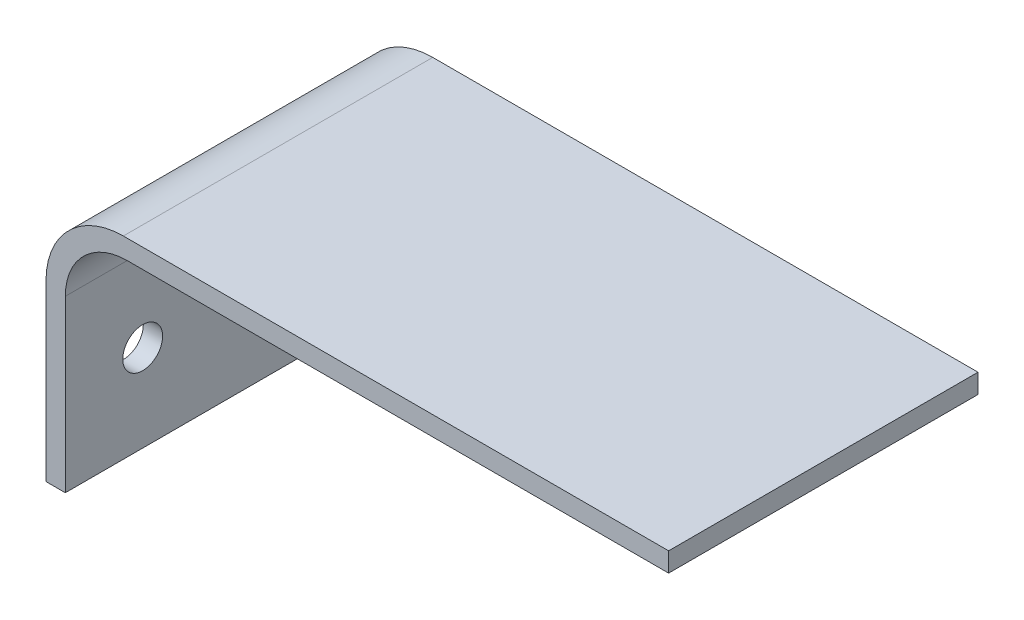
ISO-10303-21;
HEADER;
FILE_DESCRIPTION(('STEP AP214'),'2;1');
FILE_NAME('part.step','',(''),(''),'','','');
FILE_SCHEMA(('AUTOMOTIVE_DESIGN { 1 0 10303 214 1 1 1 1 }'));
ENDSEC;
DATA;
#1=APPLICATION_CONTEXT('core data for automotive mechanical design processes');
#2=APPLICATION_PROTOCOL_DEFINITION('international standard','automotive_design',2000,#1);
#3=PRODUCT_CONTEXT('',#1,'mechanical');
#4=PRODUCT('Part','Part','',(#3));
#5=PRODUCT_RELATED_PRODUCT_CATEGORY('part','',(#4));
#6=PRODUCT_DEFINITION_FORMATION('','',#4);
#7=PRODUCT_DEFINITION_CONTEXT('part definition',#1,'design');
#8=PRODUCT_DEFINITION('design','',#6,#7);
#9=PRODUCT_DEFINITION_SHAPE('','',#8);
#10=(LENGTH_UNIT() NAMED_UNIT(*) SI_UNIT(.MILLI.,.METRE.));
#11=(NAMED_UNIT(*) PLANE_ANGLE_UNIT() SI_UNIT($,.RADIAN.));
#12=(NAMED_UNIT(*) SI_UNIT($,.STERADIAN.) SOLID_ANGLE_UNIT());
#13=UNCERTAINTY_MEASURE_WITH_UNIT(LENGTH_MEASURE(1.E-05),#10,'distance_accuracy_value','');
#14=(GEOMETRIC_REPRESENTATION_CONTEXT(3) GLOBAL_UNCERTAINTY_ASSIGNED_CONTEXT((#13)) GLOBAL_UNIT_ASSIGNED_CONTEXT((#10,
#11,#12)) REPRESENTATION_CONTEXT('',''));
#15=CARTESIAN_POINT('',(0.,0.,0.));
#16=DIRECTION('',(0.,0.,1.));
#17=DIRECTION('',(1.,0.,0.));
#18=AXIS2_PLACEMENT_3D('',#15,#16,#17);
#19=CARTESIAN_POINT('',(-76.7779870962112,16.0274236258985,101.6));
#20=DIRECTION('',(0.,0.,-1.));
#21=DIRECTION('',(-1.,0.,0.));
#22=AXIS2_PLACEMENT_3D('',#19,#20,#21);
#23=CYLINDRICAL_SURFACE('',#22,25.4);
#24=CARTESIAN_POINT('',(-76.7779870962112,16.0274236258985,0.));
#25=DIRECTION('',(0.,0.,1.));
#26=DIRECTION('',(-1.,0.,0.));
#27=AXIS2_PLACEMENT_3D('',#24,#25,#26);
#28=CIRCLE('',#27,25.4);
#29=CARTESIAN_POINT('',(-76.7779870962112,41.4274236258985,0.));
#30=VERTEX_POINT('',#29);
#31=CARTESIAN_POINT('',(-102.177987096211,16.0274236258985,0.));
#32=VERTEX_POINT('',#31);
#33=EDGE_CURVE('E141',#30,#32,#28,.T.);
#34=ORIENTED_EDGE('',*,*,#33,.T.);
#35=DIRECTION('',(0.,0.,-1.));
#36=VECTOR('',#35,1.);
#37=CARTESIAN_POINT('',(-102.177987096211,16.0274236258985,101.6));
#38=LINE('',#37,#36);
#39=CARTESIAN_POINT('',(-102.177987096211,16.0274236258985,101.6));
#40=VERTEX_POINT('',#39);
#41=EDGE_CURVE('E11',#40,#32,#38,.T.);
#42=ORIENTED_EDGE('',*,*,#41,.F.);
#43=CARTESIAN_POINT('',(-76.7779870962112,16.0274236258985,101.6));
#44=DIRECTION('',(0.,0.,1.));
#45=DIRECTION('',(-1.,0.,0.));
#46=AXIS2_PLACEMENT_3D('',#43,#44,#45);
#47=CIRCLE('',#46,25.4);
#48=CARTESIAN_POINT('',(-76.7779870962112,41.4274236258985,101.6));
#49=VERTEX_POINT('',#48);
#50=EDGE_CURVE('E155',#49,#40,#47,.T.);
#51=ORIENTED_EDGE('',*,*,#50,.F.);
#52=DIRECTION('',(0.,0.,-1.));
#53=VECTOR('',#52,1.);
#54=CARTESIAN_POINT('',(-76.7779870962112,41.4274236258985,101.6));
#55=LINE('',#54,#53);
#56=EDGE_CURVE('E137',#49,#30,#55,.T.);
#57=ORIENTED_EDGE('',*,*,#56,.T.);
#58=EDGE_LOOP('',(#34,#42,#51,#57));
#59=FACE_BOUND('',#58,.T.);
#60=ADVANCED_FACE('F43',(#59),#23,.T.);
#61=CARTESIAN_POINT('',(-102.177987096211,-41.1225763741016,101.6));
#62=DIRECTION('',(1.,0.,0.));
#63=DIRECTION('',(0.,0.,-1.));
#64=AXIS2_PLACEMENT_3D('',#61,#62,#63);
#65=PLANE('',#64);
#66=CARTESIAN_POINT('',(-102.177987096211,-12.5475763741016,25.4));
#67=DIRECTION('',(-1.,0.,0.));
#68=DIRECTION('',(0.,0.,1.));
#69=AXIS2_PLACEMENT_3D('',#66,#67,#68);
#70=CIRCLE('',#69,6.54812);
#71=CARTESIAN_POINT('',(-102.177987096211,-12.5475763741016,31.94812));
#72=VERTEX_POINT('',#71);
#73=EDGE_CURVE('E168',#72,#72,#70,.T.);
#74=ORIENTED_EDGE('',*,*,#73,.F.);
#75=EDGE_LOOP('',(#74));
#76=FACE_BOUND('',#75,.T.);
#77=CARTESIAN_POINT('',(-102.177987096211,-12.5475763741016,76.2));
#78=DIRECTION('',(-1.,0.,0.));
#79=DIRECTION('',(0.,0.,-1.));
#80=AXIS2_PLACEMENT_3D('',#77,#78,#79);
#81=CIRCLE('',#80,6.54811999999999);
#82=CARTESIAN_POINT('',(-102.177987096211,-12.5475763741016,69.65188));
#83=VERTEX_POINT('',#82);
#84=EDGE_CURVE('E173',#83,#83,#81,.T.);
#85=ORIENTED_EDGE('',*,*,#84,.F.);
#86=EDGE_LOOP('',(#85));
#87=FACE_BOUND('',#86,.T.);
#88=DIRECTION('',(0.,-1.,0.));
#89=VECTOR('',#88,1.);
#90=CARTESIAN_POINT('',(-102.177987096211,-41.1225763741016,0.));
#91=LINE('',#90,#89);
#92=CARTESIAN_POINT('',(-102.177987096211,-41.1225763741016,0.));
#93=VERTEX_POINT('',#92);
#94=EDGE_CURVE('E144',#32,#93,#91,.T.);
#95=ORIENTED_EDGE('',*,*,#94,.T.);
#96=DIRECTION('',(0.,0.,-1.));
#97=VECTOR('',#96,1.);
#98=CARTESIAN_POINT('',(-102.177987096211,-41.1225763741016,101.6));
#99=LINE('',#98,#97);
#100=CARTESIAN_POINT('',(-102.177987096211,-41.1225763741016,101.6));
#101=VERTEX_POINT('',#100);
#102=EDGE_CURVE('E52',#101,#93,#99,.T.);
#103=ORIENTED_EDGE('',*,*,#102,.F.);
#104=DIRECTION('',(0.,-1.,0.));
#105=VECTOR('',#104,1.);
#106=CARTESIAN_POINT('',(-102.177987096211,-41.1225763741016,101.6));
#107=LINE('',#106,#105);
#108=EDGE_CURVE('E104',#40,#101,#107,.T.);
#109=ORIENTED_EDGE('',*,*,#108,.F.);
#110=ORIENTED_EDGE('',*,*,#41,.T.);
#111=EDGE_LOOP('',(#95,#103,#109,#110));
#112=FACE_BOUND('',#111,.T.);
#113=ADVANCED_FACE('F213',(#76,#87,#112),#65,.F.);
#114=CARTESIAN_POINT('',(-95.8279870962112,-41.1225763741016,101.6));
#115=DIRECTION('',(0.,1.,0.));
#116=DIRECTION('',(-1.,0.,0.));
#117=AXIS2_PLACEMENT_3D('',#114,#115,#116);
#118=PLANE('',#117);
#119=DIRECTION('',(1.,0.,0.));
#120=VECTOR('',#119,1.);
#121=CARTESIAN_POINT('',(-95.8279870962112,-41.1225763741016,0.));
#122=LINE('',#121,#120);
#123=CARTESIAN_POINT('',(-95.8279870962112,-41.1225763741016,0.));
#124=VERTEX_POINT('',#123);
#125=EDGE_CURVE('E146',#93,#124,#122,.T.);
#126=ORIENTED_EDGE('',*,*,#125,.T.);
#127=DIRECTION('',(0.,0.,-1.));
#128=VECTOR('',#127,1.);
#129=CARTESIAN_POINT('',(-95.8279870962112,-41.1225763741016,101.6));
#130=LINE('',#129,#128);
#131=CARTESIAN_POINT('',(-95.8279870962112,-41.1225763741016,101.6));
#132=VERTEX_POINT('',#131);
#133=EDGE_CURVE('E162',#132,#124,#130,.T.);
#134=ORIENTED_EDGE('',*,*,#133,.F.);
#135=DIRECTION('',(1.,0.,0.));
#136=VECTOR('',#135,1.);
#137=CARTESIAN_POINT('',(-95.8279870962112,-41.1225763741016,101.6));
#138=LINE('',#137,#136);
#139=EDGE_CURVE('E182',#101,#132,#138,.T.);
#140=ORIENTED_EDGE('',*,*,#139,.F.);
#141=ORIENTED_EDGE('',*,*,#102,.T.);
#142=EDGE_LOOP('',(#126,#134,#140,#141));
#143=FACE_BOUND('',#142,.T.);
#144=ADVANCED_FACE('F218',(#143),#118,.F.);
#145=CARTESIAN_POINT('',(-95.8279870962112,14.7574236258984,101.6));
#146=DIRECTION('',(-1.,0.,0.));
#147=DIRECTION('',(0.,-1.,0.));
#148=AXIS2_PLACEMENT_3D('',#145,#146,#147);
#149=PLANE('',#148);
#150=CARTESIAN_POINT('',(-95.8279870962112,-12.5475763741016,25.4));
#151=DIRECTION('',(-1.,0.,0.));
#152=DIRECTION('',(0.,-1.,0.));
#153=AXIS2_PLACEMENT_3D('',#150,#151,#152);
#154=CIRCLE('',#153,6.54812);
#155=CARTESIAN_POINT('',(-95.8279870962112,-19.0956963741016,25.4));
#156=VERTEX_POINT('',#155);
#157=EDGE_CURVE('E46',#156,#156,#154,.T.);
#158=ORIENTED_EDGE('',*,*,#157,.T.);
#159=EDGE_LOOP('',(#158));
#160=FACE_BOUND('',#159,.T.);
#161=CARTESIAN_POINT('',(-95.8279870962112,-12.5475763741016,76.2));
#162=DIRECTION('',(-1.,0.,0.));
#163=DIRECTION('',(0.,-1.,0.));
#164=AXIS2_PLACEMENT_3D('',#161,#162,#163);
#165=CIRCLE('',#164,6.54811999999999);
#166=CARTESIAN_POINT('',(-95.8279870962112,-19.0956963741016,76.2));
#167=VERTEX_POINT('',#166);
#168=EDGE_CURVE('E166',#167,#167,#165,.T.);
#169=ORIENTED_EDGE('',*,*,#168,.T.);
#170=EDGE_LOOP('',(#169));
#171=FACE_BOUND('',#170,.T.);
#172=DIRECTION('',(0.,1.,0.));
#173=VECTOR('',#172,1.);
#174=CARTESIAN_POINT('',(-95.8279870962112,14.7574236258984,0.));
#175=LINE('',#174,#173);
#176=CARTESIAN_POINT('',(-95.8279870962112,14.7574236258984,0.));
#177=VERTEX_POINT('',#176);
#178=EDGE_CURVE('E148',#124,#177,#175,.T.);
#179=ORIENTED_EDGE('',*,*,#178,.T.);
#180=DIRECTION('',(0.,0.,-1.));
#181=VECTOR('',#180,1.);
#182=CARTESIAN_POINT('',(-95.8279870962112,14.7574236258984,101.6));
#183=LINE('',#182,#181);
#184=CARTESIAN_POINT('',(-95.8279870962112,14.7574236258984,101.6));
#185=VERTEX_POINT('',#184);
#186=EDGE_CURVE('E159',#185,#177,#183,.T.);
#187=ORIENTED_EDGE('',*,*,#186,.F.);
#188=DIRECTION('',(0.,1.,0.));
#189=VECTOR('',#188,1.);
#190=CARTESIAN_POINT('',(-95.8279870962112,14.7574236258984,101.6));
#191=LINE('',#190,#189);
#192=EDGE_CURVE('E184',#132,#185,#191,.T.);
#193=ORIENTED_EDGE('',*,*,#192,.F.);
#194=ORIENTED_EDGE('',*,*,#133,.T.);
#195=EDGE_LOOP('',(#179,#187,#193,#194));
#196=FACE_BOUND('',#195,.T.);
#197=ADVANCED_FACE('F190',(#160,#171,#196),#149,.F.);
#198=CARTESIAN_POINT('',(-75.5079870962112,14.7574236258984,101.6));
#199=DIRECTION('',(0.,0.,-1.));
#200=DIRECTION('',(-1.,0.,0.));
#201=AXIS2_PLACEMENT_3D('',#198,#199,#200);
#202=CYLINDRICAL_SURFACE('',#201,20.32);
#203=CARTESIAN_POINT('',(-75.5079870962112,14.7574236258984,0.));
#204=DIRECTION('',(0.,0.,-1.));
#205=DIRECTION('',(-1.,0.,0.));
#206=AXIS2_PLACEMENT_3D('',#203,#204,#205);
#207=CIRCLE('',#206,20.32);
#208=CARTESIAN_POINT('',(-75.5079870962112,35.0774236258984,0.));
#209=VERTEX_POINT('',#208);
#210=EDGE_CURVE('E150',#177,#209,#207,.T.);
#211=ORIENTED_EDGE('',*,*,#210,.T.);
#212=DIRECTION('',(0.,0.,-1.));
#213=VECTOR('',#212,1.);
#214=CARTESIAN_POINT('',(-75.5079870962112,35.0774236258984,101.6));
#215=LINE('',#214,#213);
#216=CARTESIAN_POINT('',(-75.5079870962112,35.0774236258984,101.6));
#217=VERTEX_POINT('',#216);
#218=EDGE_CURVE('E132',#217,#209,#215,.T.);
#219=ORIENTED_EDGE('',*,*,#218,.F.);
#220=CARTESIAN_POINT('',(-75.5079870962112,14.7574236258984,101.6));
#221=DIRECTION('',(0.,0.,-1.));
#222=DIRECTION('',(-1.,0.,0.));
#223=AXIS2_PLACEMENT_3D('',#220,#221,#222);
#224=CIRCLE('',#223,20.32);
#225=EDGE_CURVE('E123',#185,#217,#224,.T.);
#226=ORIENTED_EDGE('',*,*,#225,.F.);
#227=ORIENTED_EDGE('',*,*,#186,.T.);
#228=EDGE_LOOP('',(#211,#219,#226,#227));
#229=FACE_BOUND('',#228,.T.);
#230=ADVANCED_FACE('F194',(#229),#202,.F.);
#231=CARTESIAN_POINT('',(102.292012903789,35.0774236258984,101.6));
#232=DIRECTION('',(0.,1.,0.));
#233=DIRECTION('',(0.,0.,1.));
#234=AXIS2_PLACEMENT_3D('',#231,#232,#233);
#235=PLANE('',#234);
#236=DIRECTION('',(1.,0.,0.));
#237=VECTOR('',#236,1.);
#238=CARTESIAN_POINT('',(102.292012903789,35.0774236258984,0.));
#239=LINE('',#238,#237);
#240=CARTESIAN_POINT('',(102.292012903789,35.0774236258984,0.));
#241=VERTEX_POINT('',#240);
#242=EDGE_CURVE('E131',#209,#241,#239,.T.);
#243=ORIENTED_EDGE('',*,*,#242,.T.);
#244=DIRECTION('',(0.,0.,-1.));
#245=VECTOR('',#244,1.);
#246=CARTESIAN_POINT('',(102.292012903789,35.0774236258984,101.6));
#247=LINE('',#246,#245);
#248=CARTESIAN_POINT('',(102.292012903789,35.0774236258984,101.6));
#249=VERTEX_POINT('',#248);
#250=EDGE_CURVE('E128',#249,#241,#247,.T.);
#251=ORIENTED_EDGE('',*,*,#250,.F.);
#252=DIRECTION('',(1.,0.,0.));
#253=VECTOR('',#252,1.);
#254=CARTESIAN_POINT('',(102.292012903789,35.0774236258984,101.6));
#255=LINE('',#254,#253);
#256=EDGE_CURVE('E117',#217,#249,#255,.T.);
#257=ORIENTED_EDGE('',*,*,#256,.F.);
#258=ORIENTED_EDGE('',*,*,#218,.T.);
#259=EDGE_LOOP('',(#243,#251,#257,#258));
#260=FACE_BOUND('',#259,.T.);
#261=ADVANCED_FACE('F129',(#260),#235,.F.);
#262=CARTESIAN_POINT('',(102.292012903789,35.0774236258984,101.6));
#263=DIRECTION('',(-1.,0.,0.));
#264=DIRECTION('',(0.,0.,1.));
#265=AXIS2_PLACEMENT_3D('',#262,#263,#264);
#266=PLANE('',#265);
#267=DIRECTION('',(0.,1.,0.));
#268=VECTOR('',#267,1.);
#269=CARTESIAN_POINT('',(102.292012903789,35.0774236258984,0.));
#270=LINE('',#269,#268);
#271=CARTESIAN_POINT('',(102.292012903789,41.4274236258985,0.));
#272=VERTEX_POINT('',#271);
#273=EDGE_CURVE('E90',#241,#272,#270,.T.);
#274=ORIENTED_EDGE('',*,*,#273,.T.);
#275=DIRECTION('',(0.,0.,-1.));
#276=VECTOR('',#275,1.);
#277=CARTESIAN_POINT('',(102.292012903789,41.4274236258985,101.6));
#278=LINE('',#277,#276);
#279=CARTESIAN_POINT('',(102.292012903789,41.4274236258985,101.6));
#280=VERTEX_POINT('',#279);
#281=EDGE_CURVE('E133',#280,#272,#278,.T.);
#282=ORIENTED_EDGE('',*,*,#281,.F.);
#283=DIRECTION('',(0.,1.,0.));
#284=VECTOR('',#283,1.);
#285=CARTESIAN_POINT('',(102.292012903789,35.0774236258984,101.6));
#286=LINE('',#285,#284);
#287=EDGE_CURVE('E121',#249,#280,#286,.T.);
#288=ORIENTED_EDGE('',*,*,#287,.F.);
#289=ORIENTED_EDGE('',*,*,#250,.T.);
#290=EDGE_LOOP('',(#274,#282,#288,#289));
#291=FACE_BOUND('',#290,.T.);
#292=ADVANCED_FACE('F135',(#291),#266,.F.);
#293=CARTESIAN_POINT('',(-76.7779870962112,41.4274236258985,101.6));
#294=DIRECTION('',(0.,-1.,0.));
#295=DIRECTION('',(0.,0.,-1.));
#296=AXIS2_PLACEMENT_3D('',#293,#294,#295);
#297=PLANE('',#296);
#298=DIRECTION('',(-1.,0.,0.));
#299=VECTOR('',#298,1.);
#300=CARTESIAN_POINT('',(-76.7779870962112,41.4274236258985,0.));
#301=LINE('',#300,#299);
#302=EDGE_CURVE('E96',#272,#30,#301,.T.);
#303=ORIENTED_EDGE('',*,*,#302,.T.);
#304=ORIENTED_EDGE('',*,*,#56,.F.);
#305=DIRECTION('',(-1.,0.,0.));
#306=VECTOR('',#305,1.);
#307=CARTESIAN_POINT('',(-76.7779870962112,41.4274236258985,101.6));
#308=LINE('',#307,#306);
#309=EDGE_CURVE('E61',#280,#49,#308,.T.);
#310=ORIENTED_EDGE('',*,*,#309,.F.);
#311=ORIENTED_EDGE('',*,*,#281,.T.);
#312=EDGE_LOOP('',(#303,#304,#310,#311));
#313=FACE_BOUND('',#312,.T.);
#314=ADVANCED_FACE('F202',(#313),#297,.F.);
#315=CARTESIAN_POINT('',(-76.7779870962112,16.0274236258985,101.6));
#316=DIRECTION('',(0.,0.,-1.));
#317=DIRECTION('',(-1.,0.,0.));
#318=AXIS2_PLACEMENT_3D('',#315,#316,#317);
#319=PLANE('',#318);
#320=ORIENTED_EDGE('',*,*,#50,.T.);
#321=ORIENTED_EDGE('',*,*,#108,.T.);
#322=ORIENTED_EDGE('',*,*,#139,.T.);
#323=ORIENTED_EDGE('',*,*,#192,.T.);
#324=ORIENTED_EDGE('',*,*,#225,.T.);
#325=ORIENTED_EDGE('',*,*,#256,.T.);
#326=ORIENTED_EDGE('',*,*,#287,.T.);
#327=ORIENTED_EDGE('',*,*,#309,.T.);
#328=EDGE_LOOP('',(#320,#321,#322,#323,#324,#325,#326,#327));
#329=FACE_BOUND('',#328,.T.);
#330=ADVANCED_FACE('F119',(#329),#319,.F.);
#331=CARTESIAN_POINT('',(-76.7779870962112,16.0274236258985,0.));
#332=DIRECTION('',(0.,0.,-1.));
#333=DIRECTION('',(-1.,0.,0.));
#334=AXIS2_PLACEMENT_3D('',#331,#332,#333);
#335=PLANE('',#334);
#336=ORIENTED_EDGE('',*,*,#33,.F.);
#337=ORIENTED_EDGE('',*,*,#302,.F.);
#338=ORIENTED_EDGE('',*,*,#273,.F.);
#339=ORIENTED_EDGE('',*,*,#242,.F.);
#340=ORIENTED_EDGE('',*,*,#210,.F.);
#341=ORIENTED_EDGE('',*,*,#178,.F.);
#342=ORIENTED_EDGE('',*,*,#125,.F.);
#343=ORIENTED_EDGE('',*,*,#94,.F.);
#344=EDGE_LOOP('',(#336,#337,#338,#339,#340,#341,#342,#343));
#345=FACE_BOUND('',#344,.T.);
#346=ADVANCED_FACE('F197',(#345),#335,.T.);
#347=CARTESIAN_POINT('',(202.622012903789,-12.5475763741016,76.2));
#348=DIRECTION('',(-1.,0.,0.));
#349=DIRECTION('',(0.,0.,1.));
#350=AXIS2_PLACEMENT_3D('',#347,#348,#349);
#351=CYLINDRICAL_SURFACE('',#350,6.54811999999999);
#352=ORIENTED_EDGE('',*,*,#84,.T.);
#353=EDGE_LOOP('',(#352));
#354=FACE_BOUND('',#353,.T.);
#355=ORIENTED_EDGE('',*,*,#168,.F.);
#356=EDGE_LOOP('',(#355));
#357=FACE_BOUND('',#356,.T.);
#358=ADVANCED_FACE('F261',(#354,#357),#351,.F.);
#359=CARTESIAN_POINT('',(202.622012903789,-12.5475763741016,25.4));
#360=DIRECTION('',(-1.,0.,0.));
#361=DIRECTION('',(0.,0.,1.));
#362=AXIS2_PLACEMENT_3D('',#359,#360,#361);
#363=CYLINDRICAL_SURFACE('',#362,6.54812);
#364=ORIENTED_EDGE('',*,*,#73,.T.);
#365=EDGE_LOOP('',(#364));
#366=FACE_BOUND('',#365,.T.);
#367=ORIENTED_EDGE('',*,*,#157,.F.);
#368=EDGE_LOOP('',(#367));
#369=FACE_BOUND('',#368,.T.);
#370=ADVANCED_FACE('F269',(#366,#369),#363,.F.);
#371=CLOSED_SHELL('',(#60,#113,#144,#197,#230,#261,#292,#314,#330,#346,#358,#370));
#372=MANIFOLD_SOLID_BREP('B2',#371);
#373=ADVANCED_BREP_SHAPE_REPRESENTATION('',(#18,#372),#14);
#374=SHAPE_DEFINITION_REPRESENTATION(#9,#373);
ENDSEC;
END-ISO-10303-21;
